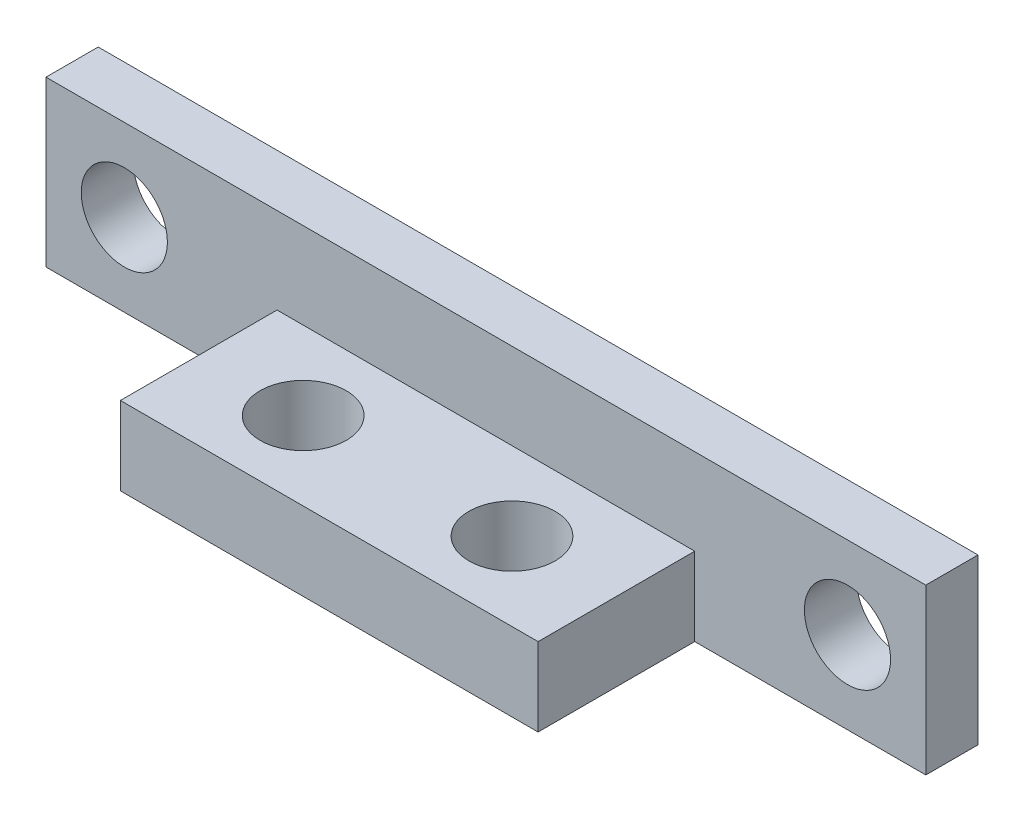
ISO-10303-21;
HEADER;
FILE_DESCRIPTION(('STEP AP214'),'2;1');
FILE_NAME('part.step','',(''),(''),'','','');
FILE_SCHEMA(('AUTOMOTIVE_DESIGN { 1 0 10303 214 1 1 1 1 }'));
ENDSEC;
DATA;
#1=APPLICATION_CONTEXT('core data for automotive mechanical design processes');
#2=APPLICATION_PROTOCOL_DEFINITION('international standard','automotive_design',2000,#1);
#3=PRODUCT_CONTEXT('',#1,'mechanical');
#4=PRODUCT('Part','Part','',(#3));
#5=PRODUCT_RELATED_PRODUCT_CATEGORY('part','',(#4));
#6=PRODUCT_DEFINITION_FORMATION('','',#4);
#7=PRODUCT_DEFINITION_CONTEXT('part definition',#1,'design');
#8=PRODUCT_DEFINITION('design','',#6,#7);
#9=PRODUCT_DEFINITION_SHAPE('','',#8);
#10=(LENGTH_UNIT() NAMED_UNIT(*) SI_UNIT(.MILLI.,.METRE.));
#11=(NAMED_UNIT(*) PLANE_ANGLE_UNIT() SI_UNIT($,.RADIAN.));
#12=(NAMED_UNIT(*) SI_UNIT($,.STERADIAN.) SOLID_ANGLE_UNIT());
#13=UNCERTAINTY_MEASURE_WITH_UNIT(LENGTH_MEASURE(1.E-05),#10,'distance_accuracy_value','');
#14=(GEOMETRIC_REPRESENTATION_CONTEXT(3) GLOBAL_UNCERTAINTY_ASSIGNED_CONTEXT((#13)) GLOBAL_UNIT_ASSIGNED_CONTEXT((#10,
#11,#12)) REPRESENTATION_CONTEXT('',''));
#15=CARTESIAN_POINT('',(0.,0.,0.));
#16=DIRECTION('',(0.,0.,1.));
#17=DIRECTION('',(1.,0.,0.));
#18=AXIS2_PLACEMENT_3D('',#15,#16,#17);
#19=CARTESIAN_POINT('',(0.,0.,2.));
#20=DIRECTION('',(0.,0.,-1.));
#21=DIRECTION('',(-1.,0.,0.));
#22=AXIS2_PLACEMENT_3D('',#19,#20,#21);
#23=PLANE('',#22);
#24=CARTESIAN_POINT('',(30.7,3.15,2.));
#25=DIRECTION('',(0.,0.,1.));
#26=DIRECTION('',(1.,0.,0.));
#27=AXIS2_PLACEMENT_3D('',#24,#25,#26);
#28=CIRCLE('',#27,1.65);
#29=CARTESIAN_POINT('',(32.35,3.15,2.));
#30=VERTEX_POINT('',#29);
#31=EDGE_CURVE('E122',#30,#30,#28,.T.);
#32=ORIENTED_EDGE('',*,*,#31,.F.);
#33=EDGE_LOOP('',(#32));
#34=FACE_BOUND('',#33,.T.);
#35=CARTESIAN_POINT('',(3.,3.15,2.));
#36=DIRECTION('',(0.,0.,1.));
#37=DIRECTION('',(1.,0.,0.));
#38=AXIS2_PLACEMENT_3D('',#35,#36,#37);
#39=CIRCLE('',#38,1.65);
#40=CARTESIAN_POINT('',(4.65,3.15,2.));
#41=VERTEX_POINT('',#40);
#42=EDGE_CURVE('E131',#41,#41,#39,.T.);
#43=ORIENTED_EDGE('',*,*,#42,.F.);
#44=EDGE_LOOP('',(#43));
#45=FACE_BOUND('',#44,.T.);
#46=DIRECTION('',(0.,-1.,0.));
#47=VECTOR('',#46,1.);
#48=CARTESIAN_POINT('',(8.85,0.,2.));
#49=LINE('',#48,#47);
#50=CARTESIAN_POINT('',(8.85,3.,2.));
#51=VERTEX_POINT('',#50);
#52=CARTESIAN_POINT('',(8.85,0.,2.));
#53=VERTEX_POINT('',#52);
#54=EDGE_CURVE('E48',#51,#53,#49,.T.);
#55=ORIENTED_EDGE('',*,*,#54,.F.);
#56=DIRECTION('',(-1.,0.,0.));
#57=VECTOR('',#56,1.);
#58=CARTESIAN_POINT('',(8.85,3.,2.));
#59=LINE('',#58,#57);
#60=CARTESIAN_POINT('',(24.85,3.,2.));
#61=VERTEX_POINT('',#60);
#62=EDGE_CURVE('E116',#61,#51,#59,.T.);
#63=ORIENTED_EDGE('',*,*,#62,.F.);
#64=DIRECTION('',(0.,1.,0.));
#65=VECTOR('',#64,1.);
#66=CARTESIAN_POINT('',(24.85,0.,2.));
#67=LINE('',#66,#65);
#68=CARTESIAN_POINT('',(24.85,0.,2.));
#69=VERTEX_POINT('',#68);
#70=EDGE_CURVE('E54',#69,#61,#67,.T.);
#71=ORIENTED_EDGE('',*,*,#70,.F.);
#72=DIRECTION('',(1.,0.,0.));
#73=VECTOR('',#72,1.);
#74=CARTESIAN_POINT('',(0.,0.,2.));
#75=LINE('',#74,#73);
#76=CARTESIAN_POINT('',(33.7,0.,2.));
#77=VERTEX_POINT('',#76);
#78=EDGE_CURVE('E140',#69,#77,#75,.T.);
#79=ORIENTED_EDGE('',*,*,#78,.T.);
#80=DIRECTION('',(0.,1.,0.));
#81=VECTOR('',#80,1.);
#82=CARTESIAN_POINT('',(33.7,0.,2.));
#83=LINE('',#82,#81);
#84=CARTESIAN_POINT('',(33.7,6.3,2.));
#85=VERTEX_POINT('',#84);
#86=EDGE_CURVE('E144',#77,#85,#83,.T.);
#87=ORIENTED_EDGE('',*,*,#86,.T.);
#88=DIRECTION('',(-1.,0.,0.));
#89=VECTOR('',#88,1.);
#90=CARTESIAN_POINT('',(0.,6.3,2.));
#91=LINE('',#90,#89);
#92=CARTESIAN_POINT('',(0.,6.3,2.));
#93=VERTEX_POINT('',#92);
#94=EDGE_CURVE('E146',#85,#93,#91,.T.);
#95=ORIENTED_EDGE('',*,*,#94,.T.);
#96=DIRECTION('',(0.,-1.,0.));
#97=VECTOR('',#96,1.);
#98=CARTESIAN_POINT('',(0.,0.,2.));
#99=LINE('',#98,#97);
#100=CARTESIAN_POINT('',(0.,0.,2.));
#101=VERTEX_POINT('',#100);
#102=EDGE_CURVE('E137',#93,#101,#99,.T.);
#103=ORIENTED_EDGE('',*,*,#102,.T.);
#104=EDGE_CURVE('E142',#101,#53,#75,.T.);
#105=ORIENTED_EDGE('',*,*,#104,.T.);
#106=EDGE_LOOP('',(#55,#63,#71,#79,#87,#95,#103,#105));
#107=FACE_BOUND('',#106,.T.);
#108=ADVANCED_FACE('F33',(#34,#45,#107),#23,.F.);
#109=CARTESIAN_POINT('',(0.,0.,0.));
#110=DIRECTION('',(0.,0.,-1.));
#111=DIRECTION('',(-1.,0.,0.));
#112=AXIS2_PLACEMENT_3D('',#109,#110,#111);
#113=PLANE('',#112);
#114=CARTESIAN_POINT('',(3.,3.15,0.));
#115=DIRECTION('',(0.,0.,1.));
#116=DIRECTION('',(1.,0.,0.));
#117=AXIS2_PLACEMENT_3D('',#114,#115,#116);
#118=CIRCLE('',#117,1.65);
#119=CARTESIAN_POINT('',(4.65,3.15,0.));
#120=VERTEX_POINT('',#119);
#121=EDGE_CURVE('E129',#120,#120,#118,.T.);
#122=ORIENTED_EDGE('',*,*,#121,.T.);
#123=EDGE_LOOP('',(#122));
#124=FACE_BOUND('',#123,.T.);
#125=DIRECTION('',(0.,-1.,0.));
#126=VECTOR('',#125,1.);
#127=CARTESIAN_POINT('',(0.,0.,0.));
#128=LINE('',#127,#126);
#129=CARTESIAN_POINT('',(0.,6.3,0.));
#130=VERTEX_POINT('',#129);
#131=CARTESIAN_POINT('',(0.,0.,0.));
#132=VERTEX_POINT('',#131);
#133=EDGE_CURVE('E134',#130,#132,#128,.T.);
#134=ORIENTED_EDGE('',*,*,#133,.F.);
#135=DIRECTION('',(-1.,0.,0.));
#136=VECTOR('',#135,1.);
#137=CARTESIAN_POINT('',(0.,6.3,0.));
#138=LINE('',#137,#136);
#139=CARTESIAN_POINT('',(33.7,6.3,0.));
#140=VERTEX_POINT('',#139);
#141=EDGE_CURVE('E141',#140,#130,#138,.T.);
#142=ORIENTED_EDGE('',*,*,#141,.F.);
#143=DIRECTION('',(0.,1.,0.));
#144=VECTOR('',#143,1.);
#145=CARTESIAN_POINT('',(33.7,0.,0.));
#146=LINE('',#145,#144);
#147=CARTESIAN_POINT('',(33.7,0.,0.));
#148=VERTEX_POINT('',#147);
#149=EDGE_CURVE('E153',#148,#140,#146,.T.);
#150=ORIENTED_EDGE('',*,*,#149,.F.);
#151=DIRECTION('',(1.,0.,0.));
#152=VECTOR('',#151,1.);
#153=CARTESIAN_POINT('',(0.,0.,0.));
#154=LINE('',#153,#152);
#155=EDGE_CURVE('E151',#132,#148,#154,.T.);
#156=ORIENTED_EDGE('',*,*,#155,.F.);
#157=EDGE_LOOP('',(#134,#142,#150,#156));
#158=FACE_BOUND('',#157,.T.);
#159=CARTESIAN_POINT('',(30.7,3.15,0.));
#160=DIRECTION('',(0.,0.,1.));
#161=DIRECTION('',(1.,0.,0.));
#162=AXIS2_PLACEMENT_3D('',#159,#160,#161);
#163=CIRCLE('',#162,1.65);
#164=CARTESIAN_POINT('',(32.35,3.15,0.));
#165=VERTEX_POINT('',#164);
#166=EDGE_CURVE('E119',#165,#165,#163,.T.);
#167=ORIENTED_EDGE('',*,*,#166,.T.);
#168=EDGE_LOOP('',(#167));
#169=FACE_BOUND('',#168,.T.);
#170=ADVANCED_FACE('F170',(#124,#158,#169),#113,.T.);
#171=CARTESIAN_POINT('',(0.,0.,2.));
#172=DIRECTION('',(1.,0.,0.));
#173=DIRECTION('',(0.,0.,-1.));
#174=AXIS2_PLACEMENT_3D('',#171,#172,#173);
#175=PLANE('',#174);
#176=ORIENTED_EDGE('',*,*,#133,.T.);
#177=DIRECTION('',(0.,0.,-1.));
#178=VECTOR('',#177,1.);
#179=CARTESIAN_POINT('',(0.,0.,2.));
#180=LINE('',#179,#178);
#181=EDGE_CURVE('E11',#101,#132,#180,.T.);
#182=ORIENTED_EDGE('',*,*,#181,.F.);
#183=ORIENTED_EDGE('',*,*,#102,.F.);
#184=DIRECTION('',(0.,0.,-1.));
#185=VECTOR('',#184,1.);
#186=CARTESIAN_POINT('',(0.,6.3,2.));
#187=LINE('',#186,#185);
#188=EDGE_CURVE('E148',#93,#130,#187,.T.);
#189=ORIENTED_EDGE('',*,*,#188,.T.);
#190=EDGE_LOOP('',(#176,#182,#183,#189));
#191=FACE_BOUND('',#190,.T.);
#192=ADVANCED_FACE('F35',(#191),#175,.F.);
#193=CARTESIAN_POINT('',(0.,0.,2.));
#194=DIRECTION('',(0.,1.,0.));
#195=DIRECTION('',(0.,0.,1.));
#196=AXIS2_PLACEMENT_3D('',#193,#194,#195);
#197=PLANE('',#196);
#198=CARTESIAN_POINT('',(12.85,0.,5.));
#199=DIRECTION('',(0.,1.,0.));
#200=DIRECTION('',(0.,0.,1.));
#201=AXIS2_PLACEMENT_3D('',#198,#199,#200);
#202=CIRCLE('',#201,1.65);
#203=CARTESIAN_POINT('',(12.85,0.,6.65));
#204=VERTEX_POINT('',#203);
#205=EDGE_CURVE('E188',#204,#204,#202,.T.);
#206=ORIENTED_EDGE('',*,*,#205,.T.);
#207=EDGE_LOOP('',(#206));
#208=FACE_BOUND('',#207,.T.);
#209=CARTESIAN_POINT('',(20.85,0.,5.));
#210=DIRECTION('',(0.,1.,0.));
#211=DIRECTION('',(0.,0.,1.));
#212=AXIS2_PLACEMENT_3D('',#209,#210,#211);
#213=CIRCLE('',#212,1.65);
#214=CARTESIAN_POINT('',(20.85,0.,6.65));
#215=VERTEX_POINT('',#214);
#216=EDGE_CURVE('E232',#215,#215,#213,.T.);
#217=ORIENTED_EDGE('',*,*,#216,.T.);
#218=EDGE_LOOP('',(#217));
#219=FACE_BOUND('',#218,.T.);
#220=ORIENTED_EDGE('',*,*,#155,.T.);
#221=DIRECTION('',(0.,0.,-1.));
#222=VECTOR('',#221,1.);
#223=CARTESIAN_POINT('',(33.7,0.,2.));
#224=LINE('',#223,#222);
#225=EDGE_CURVE('E41',#77,#148,#224,.T.);
#226=ORIENTED_EDGE('',*,*,#225,.F.);
#227=ORIENTED_EDGE('',*,*,#78,.F.);
#228=DIRECTION('',(0.,0.,-1.));
#229=VECTOR('',#228,1.);
#230=CARTESIAN_POINT('',(24.85,0.,8.));
#231=LINE('',#230,#229);
#232=CARTESIAN_POINT('',(24.85,0.,8.));
#233=VERTEX_POINT('',#232);
#234=EDGE_CURVE('E103',#233,#69,#231,.T.);
#235=ORIENTED_EDGE('',*,*,#234,.F.);
#236=DIRECTION('',(1.,0.,0.));
#237=VECTOR('',#236,1.);
#238=CARTESIAN_POINT('',(8.85,0.,8.));
#239=LINE('',#238,#237);
#240=CARTESIAN_POINT('',(8.85,0.,8.));
#241=VERTEX_POINT('',#240);
#242=EDGE_CURVE('E97',#241,#233,#239,.T.);
#243=ORIENTED_EDGE('',*,*,#242,.F.);
#244=DIRECTION('',(0.,0.,-1.));
#245=VECTOR('',#244,1.);
#246=CARTESIAN_POINT('',(8.85,0.,8.));
#247=LINE('',#246,#245);
#248=EDGE_CURVE('E101',#241,#53,#247,.T.);
#249=ORIENTED_EDGE('',*,*,#248,.T.);
#250=ORIENTED_EDGE('',*,*,#104,.F.);
#251=ORIENTED_EDGE('',*,*,#181,.T.);
#252=EDGE_LOOP('',(#220,#226,#227,#235,#243,#249,#250,#251));
#253=FACE_BOUND('',#252,.T.);
#254=ADVANCED_FACE('F99',(#208,#219,#253),#197,.F.);
#255=CARTESIAN_POINT('',(33.7,0.,2.));
#256=DIRECTION('',(-1.,0.,0.));
#257=DIRECTION('',(0.,0.,1.));
#258=AXIS2_PLACEMENT_3D('',#255,#256,#257);
#259=PLANE('',#258);
#260=ORIENTED_EDGE('',*,*,#149,.T.);
#261=DIRECTION('',(0.,0.,-1.));
#262=VECTOR('',#261,1.);
#263=CARTESIAN_POINT('',(33.7,6.3,2.));
#264=LINE('',#263,#262);
#265=EDGE_CURVE('E158',#85,#140,#264,.T.);
#266=ORIENTED_EDGE('',*,*,#265,.F.);
#267=ORIENTED_EDGE('',*,*,#86,.F.);
#268=ORIENTED_EDGE('',*,*,#225,.T.);
#269=EDGE_LOOP('',(#260,#266,#267,#268));
#270=FACE_BOUND('',#269,.T.);
#271=ADVANCED_FACE('F165',(#270),#259,.F.);
#272=CARTESIAN_POINT('',(0.,6.3,2.));
#273=DIRECTION('',(0.,-1.,0.));
#274=DIRECTION('',(0.,0.,-1.));
#275=AXIS2_PLACEMENT_3D('',#272,#273,#274);
#276=PLANE('',#275);
#277=ORIENTED_EDGE('',*,*,#141,.T.);
#278=ORIENTED_EDGE('',*,*,#188,.F.);
#279=ORIENTED_EDGE('',*,*,#94,.F.);
#280=ORIENTED_EDGE('',*,*,#265,.T.);
#281=EDGE_LOOP('',(#277,#278,#279,#280));
#282=FACE_BOUND('',#281,.T.);
#283=ADVANCED_FACE('F174',(#282),#276,.F.);
#284=CARTESIAN_POINT('',(3.,3.15,2.));
#285=DIRECTION('',(0.,0.,-1.));
#286=DIRECTION('',(-1.,0.,0.));
#287=AXIS2_PLACEMENT_3D('',#284,#285,#286);
#288=CYLINDRICAL_SURFACE('',#287,1.65);
#289=ORIENTED_EDGE('',*,*,#42,.T.);
#290=EDGE_LOOP('',(#289));
#291=FACE_BOUND('',#290,.T.);
#292=ORIENTED_EDGE('',*,*,#121,.F.);
#293=EDGE_LOOP('',(#292));
#294=FACE_BOUND('',#293,.T.);
#295=ADVANCED_FACE('F216',(#291,#294),#288,.F.);
#296=CARTESIAN_POINT('',(30.7,3.15,2.));
#297=DIRECTION('',(0.,0.,-1.));
#298=DIRECTION('',(-1.,0.,0.));
#299=AXIS2_PLACEMENT_3D('',#296,#297,#298);
#300=CYLINDRICAL_SURFACE('',#299,1.65);
#301=ORIENTED_EDGE('',*,*,#31,.T.);
#302=EDGE_LOOP('',(#301));
#303=FACE_BOUND('',#302,.T.);
#304=ORIENTED_EDGE('',*,*,#166,.F.);
#305=EDGE_LOOP('',(#304));
#306=FACE_BOUND('',#305,.T.);
#307=ADVANCED_FACE('F289',(#303,#306),#300,.F.);
#308=CARTESIAN_POINT('',(8.85,0.,8.));
#309=DIRECTION('',(1.,0.,0.));
#310=DIRECTION('',(0.,0.,-1.));
#311=AXIS2_PLACEMENT_3D('',#308,#309,#310);
#312=PLANE('',#311);
#313=ORIENTED_EDGE('',*,*,#54,.T.);
#314=ORIENTED_EDGE('',*,*,#248,.F.);
#315=DIRECTION('',(0.,-1.,0.));
#316=VECTOR('',#315,1.);
#317=CARTESIAN_POINT('',(8.85,0.,8.));
#318=LINE('',#317,#316);
#319=CARTESIAN_POINT('',(8.85,3.,8.));
#320=VERTEX_POINT('',#319);
#321=EDGE_CURVE('E107',#320,#241,#318,.T.);
#322=ORIENTED_EDGE('',*,*,#321,.F.);
#323=DIRECTION('',(0.,0.,-1.));
#324=VECTOR('',#323,1.);
#325=CARTESIAN_POINT('',(8.85,3.,8.));
#326=LINE('',#325,#324);
#327=EDGE_CURVE('E184',#320,#51,#326,.T.);
#328=ORIENTED_EDGE('',*,*,#327,.T.);
#329=EDGE_LOOP('',(#313,#314,#322,#328));
#330=FACE_BOUND('',#329,.T.);
#331=ADVANCED_FACE('F118',(#330),#312,.F.);
#332=CARTESIAN_POINT('',(24.85,0.,8.));
#333=DIRECTION('',(-1.,0.,0.));
#334=DIRECTION('',(0.,0.,1.));
#335=AXIS2_PLACEMENT_3D('',#332,#333,#334);
#336=PLANE('',#335);
#337=ORIENTED_EDGE('',*,*,#70,.T.);
#338=DIRECTION('',(0.,0.,-1.));
#339=VECTOR('',#338,1.);
#340=CARTESIAN_POINT('',(24.85,3.,8.));
#341=LINE('',#340,#339);
#342=CARTESIAN_POINT('',(24.85,3.,8.));
#343=VERTEX_POINT('',#342);
#344=EDGE_CURVE('E124',#343,#61,#341,.T.);
#345=ORIENTED_EDGE('',*,*,#344,.F.);
#346=DIRECTION('',(0.,1.,0.));
#347=VECTOR('',#346,1.);
#348=CARTESIAN_POINT('',(24.85,0.,8.));
#349=LINE('',#348,#347);
#350=EDGE_CURVE('E106',#233,#343,#349,.T.);
#351=ORIENTED_EDGE('',*,*,#350,.F.);
#352=ORIENTED_EDGE('',*,*,#234,.T.);
#353=EDGE_LOOP('',(#337,#345,#351,#352));
#354=FACE_BOUND('',#353,.T.);
#355=ADVANCED_FACE('F180',(#354),#336,.F.);
#356=CARTESIAN_POINT('',(8.85,3.,8.));
#357=DIRECTION('',(0.,-1.,0.));
#358=DIRECTION('',(0.,0.,-1.));
#359=AXIS2_PLACEMENT_3D('',#356,#357,#358);
#360=PLANE('',#359);
#361=CARTESIAN_POINT('',(12.85,3.,5.));
#362=DIRECTION('',(0.,1.,0.));
#363=DIRECTION('',(0.,0.,1.));
#364=AXIS2_PLACEMENT_3D('',#361,#362,#363);
#365=CIRCLE('',#364,1.65);
#366=CARTESIAN_POINT('',(12.85,3.,6.65));
#367=VERTEX_POINT('',#366);
#368=EDGE_CURVE('E234',#367,#367,#365,.T.);
#369=ORIENTED_EDGE('',*,*,#368,.F.);
#370=EDGE_LOOP('',(#369));
#371=FACE_BOUND('',#370,.T.);
#372=CARTESIAN_POINT('',(20.85,3.,5.));
#373=DIRECTION('',(0.,1.,0.));
#374=DIRECTION('',(0.,0.,1.));
#375=AXIS2_PLACEMENT_3D('',#372,#373,#374);
#376=CIRCLE('',#375,1.65);
#377=CARTESIAN_POINT('',(20.85,3.,6.65));
#378=VERTEX_POINT('',#377);
#379=EDGE_CURVE('E238',#378,#378,#376,.T.);
#380=ORIENTED_EDGE('',*,*,#379,.F.);
#381=EDGE_LOOP('',(#380));
#382=FACE_BOUND('',#381,.T.);
#383=ORIENTED_EDGE('',*,*,#62,.T.);
#384=ORIENTED_EDGE('',*,*,#327,.F.);
#385=DIRECTION('',(-1.,0.,0.));
#386=VECTOR('',#385,1.);
#387=CARTESIAN_POINT('',(8.85,3.,8.));
#388=LINE('',#387,#386);
#389=EDGE_CURVE('E112',#343,#320,#388,.T.);
#390=ORIENTED_EDGE('',*,*,#389,.F.);
#391=ORIENTED_EDGE('',*,*,#344,.T.);
#392=EDGE_LOOP('',(#383,#384,#390,#391));
#393=FACE_BOUND('',#392,.T.);
#394=ADVANCED_FACE('F192',(#371,#382,#393),#360,.F.);
#395=CARTESIAN_POINT('',(0.,0.,8.));
#396=DIRECTION('',(0.,0.,-1.));
#397=DIRECTION('',(-1.,0.,0.));
#398=AXIS2_PLACEMENT_3D('',#395,#396,#397);
#399=PLANE('',#398);
#400=ORIENTED_EDGE('',*,*,#321,.T.);
#401=ORIENTED_EDGE('',*,*,#242,.T.);
#402=ORIENTED_EDGE('',*,*,#350,.T.);
#403=ORIENTED_EDGE('',*,*,#389,.T.);
#404=EDGE_LOOP('',(#400,#401,#402,#403));
#405=FACE_BOUND('',#404,.T.);
#406=ADVANCED_FACE('F110',(#405),#399,.F.);
#407=CARTESIAN_POINT('',(20.85,-3.,5.));
#408=DIRECTION('',(0.,1.,0.));
#409=DIRECTION('',(0.,0.,1.));
#410=AXIS2_PLACEMENT_3D('',#407,#408,#409);
#411=CYLINDRICAL_SURFACE('',#410,1.65);
#412=ORIENTED_EDGE('',*,*,#379,.T.);
#413=EDGE_LOOP('',(#412));
#414=FACE_BOUND('',#413,.T.);
#415=ORIENTED_EDGE('',*,*,#216,.F.);
#416=EDGE_LOOP('',(#415));
#417=FACE_BOUND('',#416,.T.);
#418=ADVANCED_FACE('F200',(#414,#417),#411,.F.);
#419=CARTESIAN_POINT('',(12.85,-3.,5.));
#420=DIRECTION('',(0.,1.,0.));
#421=DIRECTION('',(0.,0.,1.));
#422=AXIS2_PLACEMENT_3D('',#419,#420,#421);
#423=CYLINDRICAL_SURFACE('',#422,1.65);
#424=ORIENTED_EDGE('',*,*,#368,.T.);
#425=EDGE_LOOP('',(#424));
#426=FACE_BOUND('',#425,.T.);
#427=ORIENTED_EDGE('',*,*,#205,.F.);
#428=EDGE_LOOP('',(#427));
#429=FACE_BOUND('',#428,.T.);
#430=ADVANCED_FACE('F245',(#426,#429),#423,.F.);
#431=CLOSED_SHELL('',(#108,#170,#192,#254,#271,#283,#295,#307,#331,#355,#394,#406,#418,#430));
#432=MANIFOLD_SOLID_BREP('B2',#431);
#433=ADVANCED_BREP_SHAPE_REPRESENTATION('',(#18,#432),#14);
#434=SHAPE_DEFINITION_REPRESENTATION(#9,#433);
ENDSEC;
END-ISO-10303-21;
